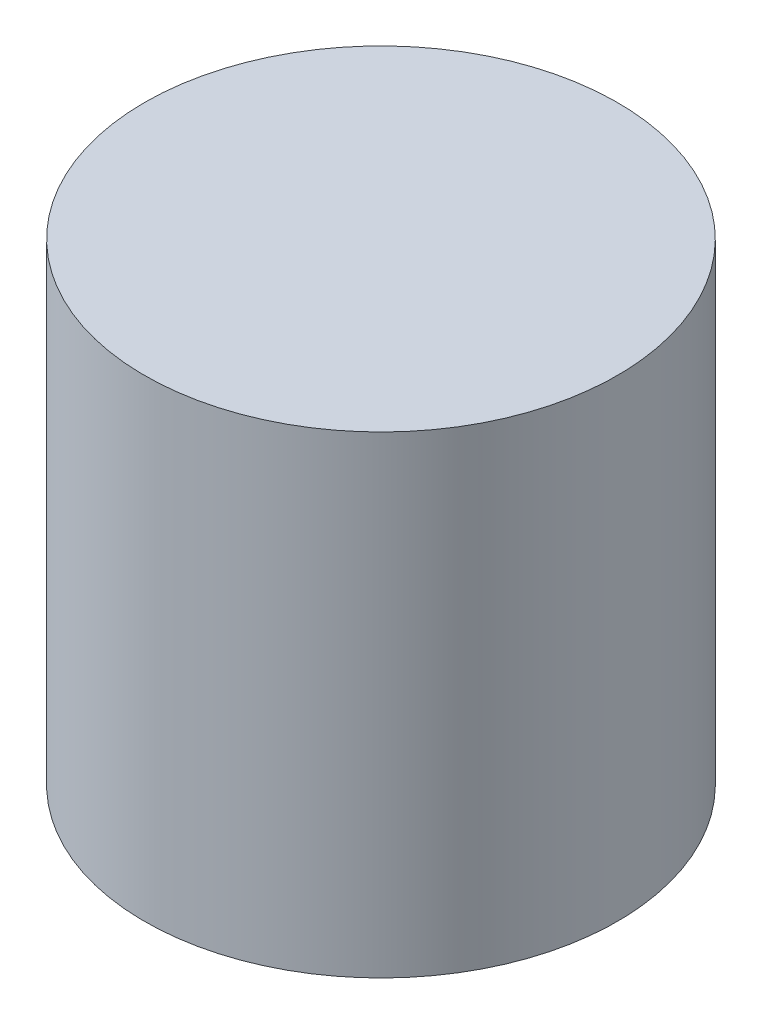
ISO-10303-21;
HEADER;
FILE_DESCRIPTION(('STEP AP214'),'2;1');
FILE_NAME('part.step','',(''),(''),'','','');
FILE_SCHEMA(('AUTOMOTIVE_DESIGN { 1 0 10303 214 1 1 1 1 }'));
ENDSEC;
DATA;
#1=APPLICATION_CONTEXT('core data for automotive mechanical design processes');
#2=APPLICATION_PROTOCOL_DEFINITION('international standard','automotive_design',2000,#1);
#3=PRODUCT_CONTEXT('',#1,'mechanical');
#4=PRODUCT('Part','Part','',(#3));
#5=PRODUCT_RELATED_PRODUCT_CATEGORY('part','',(#4));
#6=PRODUCT_DEFINITION_FORMATION('','',#4);
#7=PRODUCT_DEFINITION_CONTEXT('part definition',#1,'design');
#8=PRODUCT_DEFINITION('design','',#6,#7);
#9=PRODUCT_DEFINITION_SHAPE('','',#8);
#10=(LENGTH_UNIT() NAMED_UNIT(*) SI_UNIT(.MILLI.,.METRE.));
#11=(NAMED_UNIT(*) PLANE_ANGLE_UNIT() SI_UNIT($,.RADIAN.));
#12=(NAMED_UNIT(*) SI_UNIT($,.STERADIAN.) SOLID_ANGLE_UNIT());
#13=UNCERTAINTY_MEASURE_WITH_UNIT(LENGTH_MEASURE(1.E-05),#10,'distance_accuracy_value','');
#14=(GEOMETRIC_REPRESENTATION_CONTEXT(3) GLOBAL_UNCERTAINTY_ASSIGNED_CONTEXT((#13)) GLOBAL_UNIT_ASSIGNED_CONTEXT((#10,
#11,#12)) REPRESENTATION_CONTEXT('',''));
#15=CARTESIAN_POINT('',(0.,0.,0.));
#16=DIRECTION('',(0.,0.,1.));
#17=DIRECTION('',(1.,0.,0.));
#18=AXIS2_PLACEMENT_3D('',#15,#16,#17);
#19=CARTESIAN_POINT('',(0.,29.,0.));
#20=DIRECTION('',(0.,1.,0.));
#21=DIRECTION('',(-1.,0.,0.));
#22=AXIS2_PLACEMENT_3D('',#19,#20,#21);
#23=PLANE('',#22);
#24=CARTESIAN_POINT('',(0.,29.,0.));
#25=DIRECTION('',(0.,1.,0.));
#26=DIRECTION('',(-1.,0.,0.));
#27=AXIS2_PLACEMENT_3D('',#24,#25,#26);
#28=CIRCLE('',#27,29.);
#29=CARTESIAN_POINT('',(-29.,29.,0.));
#30=VERTEX_POINT('',#29);
#31=EDGE_CURVE('E18',#30,#30,#28,.F.);
#32=ORIENTED_EDGE('',*,*,#31,.F.);
#33=EDGE_LOOP('',(#32));
#34=FACE_BOUND('',#33,.T.);
#35=ADVANCED_FACE('F15',(#34),#23,.T.);
#36=CARTESIAN_POINT('',(-29.,-29.,0.));
#37=DIRECTION('',(0.,-1.,0.));
#38=DIRECTION('',(1.,0.,0.));
#39=AXIS2_PLACEMENT_3D('',#36,#37,#38);
#40=PLANE('',#39);
#41=CARTESIAN_POINT('',(0.,-29.,0.));
#42=DIRECTION('',(0.,1.,0.));
#43=DIRECTION('',(-1.,0.,0.));
#44=AXIS2_PLACEMENT_3D('',#41,#42,#43);
#45=CIRCLE('',#44,29.);
#46=CARTESIAN_POINT('',(-29.,-29.,0.));
#47=VERTEX_POINT('',#46);
#48=EDGE_CURVE('E10',#47,#47,#45,.T.);
#49=ORIENTED_EDGE('',*,*,#48,.F.);
#50=EDGE_LOOP('',(#49));
#51=FACE_BOUND('',#50,.T.);
#52=ADVANCED_FACE('F30',(#51),#40,.T.);
#53=CARTESIAN_POINT('',(0.,0.,0.));
#54=DIRECTION('',(0.,1.,0.));
#55=DIRECTION('',(-1.,0.,0.));
#56=AXIS2_PLACEMENT_3D('',#53,#54,#55);
#57=CYLINDRICAL_SURFACE('',#56,29.);
#58=ORIENTED_EDGE('',*,*,#48,.T.);
#59=EDGE_LOOP('',(#58));
#60=FACE_BOUND('',#59,.T.);
#61=ORIENTED_EDGE('',*,*,#31,.T.);
#62=EDGE_LOOP('',(#61));
#63=FACE_BOUND('',#62,.T.);
#64=ADVANCED_FACE('F27',(#60,#63),#57,.T.);
#65=CLOSED_SHELL('',(#35,#52,#64));
#66=MANIFOLD_SOLID_BREP('B1',#65);
#67=ADVANCED_BREP_SHAPE_REPRESENTATION('',(#18,#66),#14);
#68=SHAPE_DEFINITION_REPRESENTATION(#9,#67);
ENDSEC;
END-ISO-10303-21;
